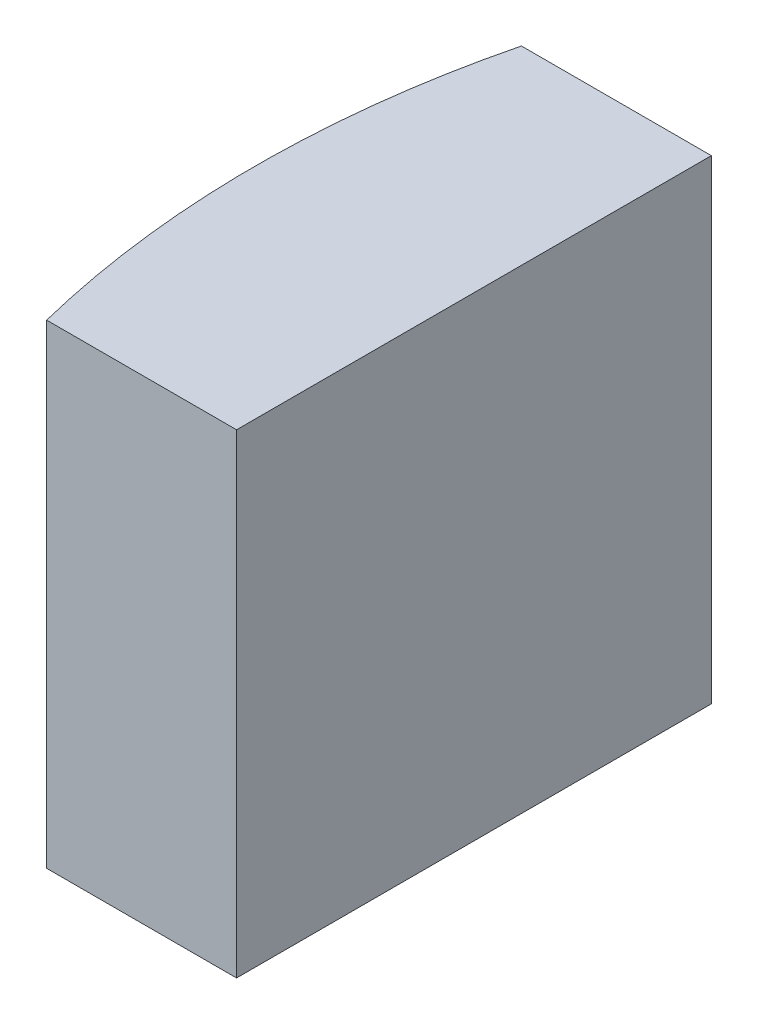
ISO-10303-21;
HEADER;
FILE_DESCRIPTION(('STEP AP214'),'2;1');
FILE_NAME('part.step','',(''),(''),'','','');
FILE_SCHEMA(('AUTOMOTIVE_DESIGN { 1 0 10303 214 1 1 1 1 }'));
ENDSEC;
DATA;
#1=APPLICATION_CONTEXT('core data for automotive mechanical design processes');
#2=APPLICATION_PROTOCOL_DEFINITION('international standard','automotive_design',2000,#1);
#3=PRODUCT_CONTEXT('',#1,'mechanical');
#4=PRODUCT('Part','Part','',(#3));
#5=PRODUCT_RELATED_PRODUCT_CATEGORY('part','',(#4));
#6=PRODUCT_DEFINITION_FORMATION('','',#4);
#7=PRODUCT_DEFINITION_CONTEXT('part definition',#1,'design');
#8=PRODUCT_DEFINITION('design','',#6,#7);
#9=PRODUCT_DEFINITION_SHAPE('','',#8);
#10=(LENGTH_UNIT() NAMED_UNIT(*) SI_UNIT(.MILLI.,.METRE.));
#11=(NAMED_UNIT(*) PLANE_ANGLE_UNIT() SI_UNIT($,.RADIAN.));
#12=(NAMED_UNIT(*) SI_UNIT($,.STERADIAN.) SOLID_ANGLE_UNIT());
#13=UNCERTAINTY_MEASURE_WITH_UNIT(LENGTH_MEASURE(1.E-05),#10,'distance_accuracy_value','');
#14=(GEOMETRIC_REPRESENTATION_CONTEXT(3) GLOBAL_UNCERTAINTY_ASSIGNED_CONTEXT((#13)) GLOBAL_UNIT_ASSIGNED_CONTEXT((#10,
#11,#12)) REPRESENTATION_CONTEXT('',''));
#15=CARTESIAN_POINT('',(0.,0.,0.));
#16=DIRECTION('',(0.,0.,1.));
#17=DIRECTION('',(1.,0.,0.));
#18=AXIS2_PLACEMENT_3D('',#15,#16,#17);
#19=CARTESIAN_POINT('',(0.,5.,0.));
#20=DIRECTION('',(0.,0.,1.));
#21=DIRECTION('',(1.,0.,0.));
#22=AXIS2_PLACEMENT_3D('',#19,#20,#21);
#23=PLANE('',#22);
#24=DIRECTION('',(-1.,0.,0.));
#25=VECTOR('',#24,1.);
#26=CARTESIAN_POINT('',(0.,0.,0.));
#27=LINE('',#26,#25);
#28=CARTESIAN_POINT('',(0.,0.,0.));
#29=VERTEX_POINT('',#28);
#30=CARTESIAN_POINT('',(-2.,0.,0.));
#31=VERTEX_POINT('',#30);
#32=EDGE_CURVE('E98',#29,#31,#27,.T.);
#33=ORIENTED_EDGE('',*,*,#32,.T.);
#34=DIRECTION('',(0.,-1.,0.));
#35=VECTOR('',#34,1.);
#36=CARTESIAN_POINT('',(-2.,5.,0.));
#37=LINE('',#36,#35);
#38=CARTESIAN_POINT('',(-2.,5.,0.));
#39=VERTEX_POINT('',#38);
#40=EDGE_CURVE('E11',#39,#31,#37,.T.);
#41=ORIENTED_EDGE('',*,*,#40,.F.);
#42=DIRECTION('',(-1.,0.,0.));
#43=VECTOR('',#42,1.);
#44=CARTESIAN_POINT('',(0.,5.,0.));
#45=LINE('',#44,#43);
#46=CARTESIAN_POINT('',(0.,5.,0.));
#47=VERTEX_POINT('',#46);
#48=EDGE_CURVE('E86',#47,#39,#45,.T.);
#49=ORIENTED_EDGE('',*,*,#48,.F.);
#50=DIRECTION('',(0.,-1.,0.));
#51=VECTOR('',#50,1.);
#52=CARTESIAN_POINT('',(0.,5.,0.));
#53=LINE('',#52,#51);
#54=EDGE_CURVE('E94',#47,#29,#53,.T.);
#55=ORIENTED_EDGE('',*,*,#54,.T.);
#56=EDGE_LOOP('',(#33,#41,#49,#55));
#57=FACE_BOUND('',#56,.T.);
#58=ADVANCED_FACE('F35',(#57),#23,.F.);
#59=CARTESIAN_POINT('',(8.02291873657569,5.,2.5));
#60=DIRECTION('',(0.,-1.,0.));
#61=DIRECTION('',(0.,0.,-1.));
#62=AXIS2_PLACEMENT_3D('',#59,#60,#61);
#63=CYLINDRICAL_SURFACE('',#62,10.33);
#64=CARTESIAN_POINT('',(8.02291873657569,0.,2.5));
#65=DIRECTION('',(0.,1.,0.));
#66=DIRECTION('',(0.,0.,1.));
#67=AXIS2_PLACEMENT_3D('',#64,#65,#66);
#68=CIRCLE('',#67,10.33);
#69=CARTESIAN_POINT('',(-2.,0.,5.));
#70=VERTEX_POINT('',#69);
#71=EDGE_CURVE('E90',#31,#70,#68,.T.);
#72=ORIENTED_EDGE('',*,*,#71,.T.);
#73=DIRECTION('',(0.,-1.,0.));
#74=VECTOR('',#73,1.);
#75=CARTESIAN_POINT('',(-2.,5.,5.));
#76=LINE('',#75,#74);
#77=CARTESIAN_POINT('',(-2.,5.,5.));
#78=VERTEX_POINT('',#77);
#79=EDGE_CURVE('E43',#78,#70,#76,.T.);
#80=ORIENTED_EDGE('',*,*,#79,.F.);
#81=CARTESIAN_POINT('',(8.02291873657569,5.,2.5));
#82=DIRECTION('',(0.,1.,0.));
#83=DIRECTION('',(0.,0.,1.));
#84=AXIS2_PLACEMENT_3D('',#81,#82,#83);
#85=CIRCLE('',#84,10.33);
#86=EDGE_CURVE('E81',#39,#78,#85,.T.);
#87=ORIENTED_EDGE('',*,*,#86,.F.);
#88=ORIENTED_EDGE('',*,*,#40,.T.);
#89=EDGE_LOOP('',(#72,#80,#87,#88));
#90=FACE_BOUND('',#89,.T.);
#91=ADVANCED_FACE('F89',(#90),#63,.T.);
#92=CARTESIAN_POINT('',(0.,5.,5.));
#93=DIRECTION('',(0.,0.,-1.));
#94=DIRECTION('',(-1.,0.,0.));
#95=AXIS2_PLACEMENT_3D('',#92,#93,#94);
#96=PLANE('',#95);
#97=DIRECTION('',(1.,0.,0.));
#98=VECTOR('',#97,1.);
#99=CARTESIAN_POINT('',(0.,0.,5.));
#100=LINE('',#99,#98);
#101=CARTESIAN_POINT('',(0.,0.,5.));
#102=VERTEX_POINT('',#101);
#103=EDGE_CURVE('E68',#70,#102,#100,.T.);
#104=ORIENTED_EDGE('',*,*,#103,.T.);
#105=DIRECTION('',(0.,-1.,0.));
#106=VECTOR('',#105,1.);
#107=CARTESIAN_POINT('',(0.,5.,5.));
#108=LINE('',#107,#106);
#109=CARTESIAN_POINT('',(0.,5.,5.));
#110=VERTEX_POINT('',#109);
#111=EDGE_CURVE('E91',#110,#102,#108,.T.);
#112=ORIENTED_EDGE('',*,*,#111,.F.);
#113=DIRECTION('',(1.,0.,0.));
#114=VECTOR('',#113,1.);
#115=CARTESIAN_POINT('',(0.,5.,5.));
#116=LINE('',#115,#114);
#117=EDGE_CURVE('E84',#78,#110,#116,.T.);
#118=ORIENTED_EDGE('',*,*,#117,.F.);
#119=ORIENTED_EDGE('',*,*,#79,.T.);
#120=EDGE_LOOP('',(#104,#112,#118,#119));
#121=FACE_BOUND('',#120,.T.);
#122=ADVANCED_FACE('F92',(#121),#96,.F.);
#123=CARTESIAN_POINT('',(0.,5.,0.));
#124=DIRECTION('',(-1.,0.,0.));
#125=DIRECTION('',(0.,0.,1.));
#126=AXIS2_PLACEMENT_3D('',#123,#124,#125);
#127=PLANE('',#126);
#128=DIRECTION('',(0.,0.,-1.));
#129=VECTOR('',#128,1.);
#130=CARTESIAN_POINT('',(0.,0.,0.));
#131=LINE('',#130,#129);
#132=EDGE_CURVE('E74',#102,#29,#131,.T.);
#133=ORIENTED_EDGE('',*,*,#132,.T.);
#134=ORIENTED_EDGE('',*,*,#54,.F.);
#135=DIRECTION('',(0.,0.,-1.));
#136=VECTOR('',#135,1.);
#137=CARTESIAN_POINT('',(0.,5.,0.));
#138=LINE('',#137,#136);
#139=EDGE_CURVE('E51',#110,#47,#138,.T.);
#140=ORIENTED_EDGE('',*,*,#139,.F.);
#141=ORIENTED_EDGE('',*,*,#111,.T.);
#142=EDGE_LOOP('',(#133,#134,#140,#141));
#143=FACE_BOUND('',#142,.T.);
#144=ADVANCED_FACE('F105',(#143),#127,.F.);
#145=CARTESIAN_POINT('',(8.02291873657569,5.,2.5));
#146=DIRECTION('',(0.,1.,0.));
#147=DIRECTION('',(0.,0.,1.));
#148=AXIS2_PLACEMENT_3D('',#145,#146,#147);
#149=PLANE('',#148);
#150=ORIENTED_EDGE('',*,*,#48,.T.);
#151=ORIENTED_EDGE('',*,*,#86,.T.);
#152=ORIENTED_EDGE('',*,*,#117,.T.);
#153=ORIENTED_EDGE('',*,*,#139,.T.);
#154=EDGE_LOOP('',(#150,#151,#152,#153));
#155=FACE_BOUND('',#154,.T.);
#156=ADVANCED_FACE('F82',(#155),#149,.T.);
#157=CARTESIAN_POINT('',(8.02291873657569,0.,2.5));
#158=DIRECTION('',(0.,1.,0.));
#159=DIRECTION('',(0.,0.,1.));
#160=AXIS2_PLACEMENT_3D('',#157,#158,#159);
#161=PLANE('',#160);
#162=ORIENTED_EDGE('',*,*,#32,.F.);
#163=ORIENTED_EDGE('',*,*,#132,.F.);
#164=ORIENTED_EDGE('',*,*,#103,.F.);
#165=ORIENTED_EDGE('',*,*,#71,.F.);
#166=EDGE_LOOP('',(#162,#163,#164,#165));
#167=FACE_BOUND('',#166,.T.);
#168=ADVANCED_FACE('F108',(#167),#161,.F.);
#169=CLOSED_SHELL('',(#58,#91,#122,#144,#156,#168));
#170=MANIFOLD_SOLID_BREP('B2',#169);
#171=ADVANCED_BREP_SHAPE_REPRESENTATION('',(#18,#170),#14);
#172=SHAPE_DEFINITION_REPRESENTATION(#9,#171);
ENDSEC;
END-ISO-10303-21;
